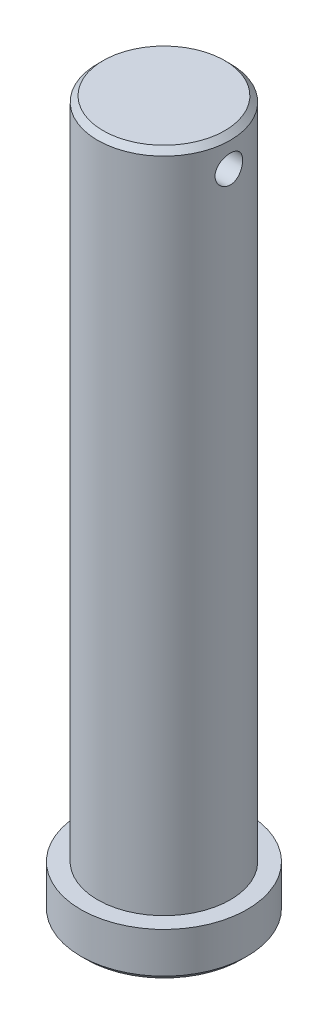
ISO-10303-21;
HEADER;
FILE_DESCRIPTION(('STEP AP214'),'2;1');
FILE_NAME('part.step','',(''),(''),'','','');
FILE_SCHEMA(('AUTOMOTIVE_DESIGN { 1 0 10303 214 1 1 1 1 }'));
ENDSEC;
DATA;
#1=APPLICATION_CONTEXT('core data for automotive mechanical design processes');
#2=APPLICATION_PROTOCOL_DEFINITION('international standard','automotive_design',2000,#1);
#3=PRODUCT_CONTEXT('',#1,'mechanical');
#4=PRODUCT('Part','Part','',(#3));
#5=PRODUCT_RELATED_PRODUCT_CATEGORY('part','',(#4));
#6=PRODUCT_DEFINITION_FORMATION('','',#4);
#7=PRODUCT_DEFINITION_CONTEXT('part definition',#1,'design');
#8=PRODUCT_DEFINITION('design','',#6,#7);
#9=PRODUCT_DEFINITION_SHAPE('','',#8);
#10=(LENGTH_UNIT() NAMED_UNIT(*) SI_UNIT(.MILLI.,.METRE.));
#11=(NAMED_UNIT(*) PLANE_ANGLE_UNIT() SI_UNIT($,.RADIAN.));
#12=(NAMED_UNIT(*) SI_UNIT($,.STERADIAN.) SOLID_ANGLE_UNIT());
#13=UNCERTAINTY_MEASURE_WITH_UNIT(LENGTH_MEASURE(1.E-05),#10,'distance_accuracy_value','');
#14=(GEOMETRIC_REPRESENTATION_CONTEXT(3) GLOBAL_UNCERTAINTY_ASSIGNED_CONTEXT((#13)) GLOBAL_UNIT_ASSIGNED_CONTEXT((#10,
#11,#12)) REPRESENTATION_CONTEXT('',''));
#15=CARTESIAN_POINT('',(0.,0.,0.));
#16=DIRECTION('',(0.,0.,1.));
#17=DIRECTION('',(1.,0.,0.));
#18=AXIS2_PLACEMENT_3D('',#15,#16,#17);
#19=CARTESIAN_POINT('',(0.,0.,0.));
#20=DIRECTION('',(0.,1.,0.));
#21=DIRECTION('',(0.,0.,1.));
#22=AXIS2_PLACEMENT_3D('',#19,#20,#21);
#23=PLANE('',#22);
#24=CARTESIAN_POINT('',(0.,-1.85615411929518E-13,0.));
#25=DIRECTION('',(0.,1.,0.));
#26=DIRECTION('',(0.,0.,1.));
#27=AXIS2_PLACEMENT_3D('',#24,#25,#26);
#28=CIRCLE('',#27,11.1506000000002);
#29=CARTESIAN_POINT('',(0.,-1.85615411929518E-13,11.1506000000002));
#30=VERTEX_POINT('',#29);
#31=EDGE_CURVE('E18',#30,#30,#28,.T.);
#32=ORIENTED_EDGE('',*,*,#31,.F.);
#33=EDGE_LOOP('',(#32));
#34=FACE_BOUND('',#33,.T.);
#35=ADVANCED_FACE('F15',(#34),#23,.F.);
#36=CARTESIAN_POINT('',(0.,0.787399999999931,0.));
#37=DIRECTION('',(0.,1.,0.));
#38=DIRECTION('',(0.,0.,1.));
#39=AXIS2_PLACEMENT_3D('',#36,#37,#38);
#40=CONICAL_SURFACE('',#39,11.9380000000001,0.7853981633973);
#41=CARTESIAN_POINT('',(0.,0.7874,0.));
#42=DIRECTION('',(0.,1.,0.));
#43=DIRECTION('',(0.,0.,1.));
#44=AXIS2_PLACEMENT_3D('',#41,#42,#43);
#45=CIRCLE('',#44,11.938);
#46=CARTESIAN_POINT('',(0.,0.7874,11.938));
#47=VERTEX_POINT('',#46);
#48=EDGE_CURVE('E35',#47,#47,#45,.T.);
#49=ORIENTED_EDGE('',*,*,#48,.F.);
#50=EDGE_LOOP('',(#49));
#51=FACE_BOUND('',#50,.T.);
#52=ORIENTED_EDGE('',*,*,#31,.T.);
#53=EDGE_LOOP('',(#52));
#54=FACE_BOUND('',#53,.T.);
#55=ADVANCED_FACE('F75',(#51,#54),#40,.T.);
#56=CARTESIAN_POINT('',(0.,0.,0.));
#57=DIRECTION('',(0.,1.,0.));
#58=DIRECTION('',(0.,0.,1.));
#59=AXIS2_PLACEMENT_3D('',#56,#57,#58);
#60=CYLINDRICAL_SURFACE('',#59,11.938);
#61=CARTESIAN_POINT('',(0.,6.604,0.));
#62=DIRECTION('',(0.,1.,0.));
#63=DIRECTION('',(0.,0.,1.));
#64=AXIS2_PLACEMENT_3D('',#61,#62,#63);
#65=CIRCLE('',#64,11.938);
#66=CARTESIAN_POINT('',(0.,6.604,11.938));
#67=VERTEX_POINT('',#66);
#68=EDGE_CURVE('E64',#67,#67,#65,.T.);
#69=ORIENTED_EDGE('',*,*,#68,.F.);
#70=EDGE_LOOP('',(#69));
#71=FACE_BOUND('',#70,.T.);
#72=ORIENTED_EDGE('',*,*,#48,.T.);
#73=EDGE_LOOP('',(#72));
#74=FACE_BOUND('',#73,.T.);
#75=ADVANCED_FACE('F81',(#71,#74),#60,.T.);
#76=CARTESIAN_POINT('',(0.,101.854,0.));
#77=DIRECTION('',(0.,1.,0.));
#78=DIRECTION('',(0.,0.,1.));
#79=AXIS2_PLACEMENT_3D('',#76,#77,#78);
#80=PLANE('',#79);
#81=CARTESIAN_POINT('',(0.,101.854000000005,0.));
#82=DIRECTION('',(0.,-1.,0.));
#83=DIRECTION('',(1.,0.,0.));
#84=AXIS2_PLACEMENT_3D('',#81,#82,#83);
#85=CIRCLE('',#84,8.72998000000516);
#86=CARTESIAN_POINT('',(8.72998000000516,101.854000000005,0.));
#87=VERTEX_POINT('',#86);
#88=EDGE_CURVE('E62',#87,#87,#85,.T.);
#89=ORIENTED_EDGE('',*,*,#88,.F.);
#90=EDGE_LOOP('',(#89));
#91=FACE_BOUND('',#90,.T.);
#92=ADVANCED_FACE('F86',(#91),#80,.T.);
#93=CARTESIAN_POINT('',(0.,6.604,0.));
#94=DIRECTION('',(0.,1.,0.));
#95=DIRECTION('',(0.,0.,1.));
#96=AXIS2_PLACEMENT_3D('',#93,#94,#95);
#97=PLANE('',#96);
#98=CARTESIAN_POINT('',(0.,6.604,0.));
#99=DIRECTION('',(0.,1.,0.));
#100=DIRECTION('',(0.,0.,1.));
#101=AXIS2_PLACEMENT_3D('',#98,#99,#100);
#102=CIRCLE('',#101,9.525);
#103=CARTESIAN_POINT('',(0.,6.604,9.525));
#104=VERTEX_POINT('',#103);
#105=EDGE_CURVE('E60',#104,#104,#102,.T.);
#106=ORIENTED_EDGE('',*,*,#105,.F.);
#107=EDGE_LOOP('',(#106));
#108=FACE_BOUND('',#107,.T.);
#109=ORIENTED_EDGE('',*,*,#68,.T.);
#110=EDGE_LOOP('',(#109));
#111=FACE_BOUND('',#110,.T.);
#112=ADVANCED_FACE('F92',(#108,#111),#97,.T.);
#113=CARTESIAN_POINT('',(0.,101.058980000005,0.));
#114=DIRECTION('',(0.,-1.,0.));
#115=DIRECTION('',(1.,0.,0.));
#116=AXIS2_PLACEMENT_3D('',#113,#114,#115);
#117=CONICAL_SURFACE('',#116,9.52500000000503,0.7853981633973);
#118=CARTESIAN_POINT('',(0.,101.05898,0.));
#119=DIRECTION('',(0.,1.,0.));
#120=DIRECTION('',(0.,0.,1.));
#121=AXIS2_PLACEMENT_3D('',#118,#119,#120);
#122=CIRCLE('',#121,9.525);
#123=CARTESIAN_POINT('',(0.,101.05898,9.525));
#124=VERTEX_POINT('',#123);
#125=EDGE_CURVE('E22',#124,#124,#122,.F.);
#126=ORIENTED_EDGE('',*,*,#125,.F.);
#127=EDGE_LOOP('',(#126));
#128=FACE_BOUND('',#127,.T.);
#129=ORIENTED_EDGE('',*,*,#88,.T.);
#130=EDGE_LOOP('',(#129));
#131=FACE_BOUND('',#130,.T.);
#132=ADVANCED_FACE('F51',(#128,#131),#117,.T.);
#133=CARTESIAN_POINT('',(14.3256,97.488375,0.));
#134=DIRECTION('',(-1.,0.,0.));
#135=DIRECTION('',(0.,0.,1.));
#136=AXIS2_PLACEMENT_3D('',#133,#134,#135);
#137=CYLINDRICAL_SURFACE('',#136,1.9812);
#138=CARTESIAN_POINT('',(-9.525,95.507175,0.));
#139=CARTESIAN_POINT('',(-9.52499733400497,95.5071803254945,-0.109898035382377));
#140=CARTESIAN_POINT('',(-9.52307669732504,95.5163586812984,-0.219931440414718));
#141=CARTESIAN_POINT('',(-9.51559391871347,95.5528226969649,-0.436971409090453));
#142=CARTESIAN_POINT('',(-9.51002462045901,95.5801439429235,-0.543971592338459));
#143=CARTESIAN_POINT('',(-9.49586614865825,95.6520102567,-0.751642585302424));
#144=CARTESIAN_POINT('',(-9.48728138552551,95.6965301792042,-0.852322387059948));
#145=CARTESIAN_POINT('',(-9.4680246853225,95.8014640078079,-1.04474686610228));
#146=CARTESIAN_POINT('',(-9.45735341654282,95.8618728269575,-1.13649439026509));
#147=CARTESIAN_POINT('',(-9.43491881389945,95.9978169785548,-1.30983991814781));
#148=CARTESIAN_POINT('',(-9.42314293616179,96.0735412545978,-1.39128814858152));
#149=CARTESIAN_POINT('',(-9.39991595616109,96.2375643933777,-1.54042704035267));
#150=CARTESIAN_POINT('',(-9.38846489828002,96.3258649646552,-1.60811582937659));
#151=CARTESIAN_POINT('',(-9.36706311296609,96.513609837891,-1.72844971662134));
#152=CARTESIAN_POINT('',(-9.3571283295226,96.6131556364854,-1.78093954791731));
#153=CARTESIAN_POINT('',(-9.34006120278303,96.8198942133164,-1.8683896516886));
#154=CARTESIAN_POINT('',(-9.33292853513895,96.9270861048113,-1.90335195312422));
#155=CARTESIAN_POINT('',(-9.32239931167411,97.1444714195906,-1.95426944770922));
#156=CARTESIAN_POINT('',(-9.31895139296922,97.2546010369489,-1.97048620896546));
#157=CARTESIAN_POINT('',(-9.31602760370587,97.4760678387695,-1.98426509053073));
#158=CARTESIAN_POINT('',(-9.31655129894681,97.587404889899,-1.98182925005348));
#159=CARTESIAN_POINT('',(-9.32146495970641,97.8061985198805,-1.95858319077408));
#160=CARTESIAN_POINT('',(-9.32579144726086,97.9136887891243,-1.93807463560147));
#161=CARTESIAN_POINT('',(-9.33772313745262,98.1236697137376,-1.87974193462299));
#162=CARTESIAN_POINT('',(-9.34532853258825,98.2261600751789,-1.8419167721844));
#163=CARTESIAN_POINT('',(-9.36302529491787,98.4240944495021,-1.74973981163127));
#164=CARTESIAN_POINT('',(-9.37313439671364,98.5194815900337,-1.69526943658951));
#165=CARTESIAN_POINT('',(-9.39468741611899,98.6998672031169,-1.57143600057498));
#166=CARTESIAN_POINT('',(-9.40613140224411,98.7848651419635,-1.50207217501313));
#167=CARTESIAN_POINT('',(-9.4293372000749,98.943792187407,-1.34882667414788));
#168=CARTESIAN_POINT('',(-9.44110088057167,99.0174757188536,-1.26469040590461));
#169=CARTESIAN_POINT('',(-9.46342398033929,99.1497560612173,-1.08508400245671));
#170=CARTESIAN_POINT('',(-9.47398287168117,99.2083462723974,-0.989608935793951));
#171=CARTESIAN_POINT('',(-9.49273720855679,99.3088252310339,-0.789725056162616));
#172=CARTESIAN_POINT('',(-9.50092652290055,99.3506707573991,-0.685293958095323));
#173=CARTESIAN_POINT('',(-9.51396049245898,99.4160715756187,-0.470808125859176));
#174=CARTESIAN_POINT('',(-9.51881215860784,99.4396652197374,-0.360765704479302));
#175=CARTESIAN_POINT('',(-9.52281462907828,99.4590455665438,-0.208229520190315));
#176=CARTESIAN_POINT('',(-9.52363228035808,99.4629906549401,-0.166691564302521));
#177=CARTESIAN_POINT('',(-9.52472547240529,99.4682563847887,-0.0834422454389682));
#178=CARTESIAN_POINT('',(-9.52500101234134,99.4695770222162,-0.0417308821973752));
#179=CARTESIAN_POINT('',(-9.52499733400497,99.4695696745054,0.109898035382374));
#180=CARTESIAN_POINT('',(-9.52307669732504,99.4603913187016,0.219931440414715));
#181=CARTESIAN_POINT('',(-9.51559391871347,99.4239273030351,0.436971409090451));
#182=CARTESIAN_POINT('',(-9.51002462045901,99.3966060570764,0.543971592338457));
#183=CARTESIAN_POINT('',(-9.49586614865825,99.3247397433,0.751642585302427));
#184=CARTESIAN_POINT('',(-9.48728138552551,99.2802198207958,0.852322387059954));
#185=CARTESIAN_POINT('',(-9.4680246853225,99.175285992192,1.04474686610229));
#186=CARTESIAN_POINT('',(-9.45735341654283,99.1148771730425,1.13649439026509));
#187=CARTESIAN_POINT('',(-9.43491881389945,98.9789330214452,1.30983991814781));
#188=CARTESIAN_POINT('',(-9.42314293616179,98.9032087454022,1.39128814858152));
#189=CARTESIAN_POINT('',(-9.39991595616108,98.7391856066223,1.54042704035267));
#190=CARTESIAN_POINT('',(-9.38846489828002,98.6508850353448,1.60811582937659));
#191=CARTESIAN_POINT('',(-9.36706311296609,98.4631401621089,1.72844971662134));
#192=CARTESIAN_POINT('',(-9.3571283295226,98.3635943635146,1.78093954791731));
#193=CARTESIAN_POINT('',(-9.34006120278303,98.1568557866836,1.8683896516886));
#194=CARTESIAN_POINT('',(-9.33292853513895,98.0496638951887,1.90335195312422));
#195=CARTESIAN_POINT('',(-9.32239931167411,97.8322785804094,1.95426944770922));
#196=CARTESIAN_POINT('',(-9.31895139296922,97.7221489630511,1.97048620896546));
#197=CARTESIAN_POINT('',(-9.31602760370587,97.5006821612304,1.98426509053073));
#198=CARTESIAN_POINT('',(-9.31655129894681,97.389345110101,1.98182925005348));
#199=CARTESIAN_POINT('',(-9.32146495970641,97.1705514801195,1.95858319077408));
#200=CARTESIAN_POINT('',(-9.32579144726086,97.0630612108757,1.93807463560147));
#201=CARTESIAN_POINT('',(-9.33772313745261,96.8530802862624,1.87974193462299));
#202=CARTESIAN_POINT('',(-9.34532853258825,96.7505899248211,1.8419167721844));
#203=CARTESIAN_POINT('',(-9.36302529491787,96.5526555504979,1.74973981163128));
#204=CARTESIAN_POINT('',(-9.37313439671363,96.4572684099663,1.69526943658953));
#205=CARTESIAN_POINT('',(-9.39468741611899,96.2768827968831,1.57143600057499));
#206=CARTESIAN_POINT('',(-9.40613140224411,96.1918848580364,1.50207217501313));
#207=CARTESIAN_POINT('',(-9.4293372000749,96.032957812593,1.34882667414788));
#208=CARTESIAN_POINT('',(-9.44110088057167,95.9592742811463,1.26469040590461));
#209=CARTESIAN_POINT('',(-9.46342398033929,95.8269939387827,1.08508400245671));
#210=CARTESIAN_POINT('',(-9.47398287168117,95.7684037276025,0.989608935793951));
#211=CARTESIAN_POINT('',(-9.49273720855679,95.6679247689661,0.789725056162617));
#212=CARTESIAN_POINT('',(-9.50092652290055,95.6260792426008,0.685293958095324));
#213=CARTESIAN_POINT('',(-9.51396049245898,95.5606784243813,0.470808125859179));
#214=CARTESIAN_POINT('',(-9.51881215860784,95.5370847802625,0.360765704479305));
#215=CARTESIAN_POINT('',(-9.52281462907828,95.5177044334562,0.208229520190316));
#216=CARTESIAN_POINT('',(-9.52363228035808,95.5137593450598,0.166691564302522));
#217=CARTESIAN_POINT('',(-9.52472547240529,95.5084936152113,0.0834422454389671));
#218=CARTESIAN_POINT('',(-9.52500101234134,95.5071729777838,0.0417308821973735));
#219=CARTESIAN_POINT('',(-9.525,95.507175,0.));
#220=B_SPLINE_CURVE_WITH_KNOTS('',3,(#138,#139,#140,#141,#142,#143,#144,#145,#146,#147,#148,
#149,#150,#151,#152,#153,#154,#155,#156,#157,#158,#159,#160,#161,#162,#163,#164,#165,#166,#167,
#168,#169,#170,#171,#172,#173,#174,#175,#176,#177,#178,#179,#180,#181,#182,#183,#184,#185,#186,
#187,#188,#189,#190,#191,#192,#193,#194,#195,#196,#197,#198,#199,#200,#201,#202,#203,#204,#205,
#206,#207,#208,#209,#210,#211,#212,#213,#214,#215,#216,#217,#218,#219),.UNSPECIFIED.,.T.,.F.,(4,
2,2,2,2,2,2,2,2,2,2,2,2,2,2,2,2,2,2,2,2,2,2,2,2,2,2,2,2,2,2,2,2,2,2,2,2,2,2,2,4),(0.,
0.329534495870123,0.659717268896652,0.989419114342882,1.31901553147453,1.65295773196094,
1.98694534319835,2.32423332003639,2.66148224390856,2.99396624978096,3.32641390703669,
3.65341539132337,3.98043607585186,4.30984295074753,4.63926674053772,4.97505496986407,
5.31098977838236,5.64778618773076,5.98387295753687,6.10900480443579,6.23413684323229,
6.56367133910241,6.89385411212894,7.22355595757519,7.55315237470682,7.88709457519322,
8.22108218643064,8.55837016326868,8.89561908714086,9.22810309301325,9.56055075026898,
9.88755223455565,10.2145729190841,10.5439797939798,10.87340358377,11.2091918130964,
11.5451266216146,11.881923030963,12.2180098007692,12.3431416476681,12.4682736864646),.UNSPECIFIED.);
#221=CARTESIAN_POINT('',(-9.525,95.507175,0.));
#222=VERTEX_POINT('',#221);
#223=EDGE_CURVE('E27',#222,#222,#220,.T.);
#224=ORIENTED_EDGE('',*,*,#223,.F.);
#225=EDGE_LOOP('',(#224));
#226=FACE_BOUND('',#225,.T.);
#227=CARTESIAN_POINT('',(9.525,99.469575,0.));
#228=CARTESIAN_POINT('',(9.52499733400497,99.4695696745054,-0.109898035382375));
#229=CARTESIAN_POINT('',(9.52307669732504,99.4603913187016,-0.219931440414716));
#230=CARTESIAN_POINT('',(9.51559391871347,99.4239273030351,-0.436971409090452));
#231=CARTESIAN_POINT('',(9.51002462045901,99.3966060570764,-0.543971592338458));
#232=CARTESIAN_POINT('',(9.49586614865825,99.3247397433,-0.751642585302427));
#233=CARTESIAN_POINT('',(9.48728138552551,99.2802198207958,-0.852322387059954));
#234=CARTESIAN_POINT('',(9.4680246853225,99.175285992192,-1.04474686610229));
#235=CARTESIAN_POINT('',(9.45735341654282,99.1148771730425,-1.13649439026509));
#236=CARTESIAN_POINT('',(9.43491881389945,98.9789330214452,-1.30983991814781));
#237=CARTESIAN_POINT('',(9.42314293616179,98.9032087454022,-1.39128814858152));
#238=CARTESIAN_POINT('',(9.39991595616109,98.7391856066223,-1.54042704035267));
#239=CARTESIAN_POINT('',(9.38846489828002,98.6508850353448,-1.60811582937659));
#240=CARTESIAN_POINT('',(9.36706311296609,98.4631401621089,-1.72844971662134));
#241=CARTESIAN_POINT('',(9.3571283295226,98.3635943635146,-1.78093954791731));
#242=CARTESIAN_POINT('',(9.34006120278303,98.1568557866836,-1.8683896516886));
#243=CARTESIAN_POINT('',(9.33292853513895,98.0496638951887,-1.90335195312422));
#244=CARTESIAN_POINT('',(9.32239931167411,97.8322785804094,-1.95426944770922));
#245=CARTESIAN_POINT('',(9.31895139296922,97.7221489630511,-1.97048620896546));
#246=CARTESIAN_POINT('',(9.31602760370587,97.5006821612304,-1.98426509053073));
#247=CARTESIAN_POINT('',(9.31655129894681,97.389345110101,-1.98182925005348));
#248=CARTESIAN_POINT('',(9.32146495970641,97.1705514801195,-1.95858319077408));
#249=CARTESIAN_POINT('',(9.32579144726086,97.0630612108757,-1.93807463560147));
#250=CARTESIAN_POINT('',(9.33772313745261,96.8530802862624,-1.87974193462299));
#251=CARTESIAN_POINT('',(9.34532853258825,96.7505899248211,-1.8419167721844));
#252=CARTESIAN_POINT('',(9.36302529491787,96.5526555504979,-1.74973981163127));
#253=CARTESIAN_POINT('',(9.37313439671364,96.4572684099663,-1.69526943658952));
#254=CARTESIAN_POINT('',(9.39468741611899,96.2768827968831,-1.57143600057498));
#255=CARTESIAN_POINT('',(9.40613140224411,96.1918848580364,-1.50207217501313));
#256=CARTESIAN_POINT('',(9.42933720007491,96.032957812593,-1.34882667414788));
#257=CARTESIAN_POINT('',(9.44110088057167,95.9592742811463,-1.26469040590461));
#258=CARTESIAN_POINT('',(9.46342398033929,95.8269939387827,-1.08508400245671));
#259=CARTESIAN_POINT('',(9.47398287168117,95.7684037276025,-0.989608935793951));
#260=CARTESIAN_POINT('',(9.49273720855679,95.6679247689661,-0.789725056162617));
#261=CARTESIAN_POINT('',(9.50092652290055,95.6260792426008,-0.685293958095323));
#262=CARTESIAN_POINT('',(9.51396049245898,95.5606784243813,-0.470808125859177));
#263=CARTESIAN_POINT('',(9.51881215860784,95.5370847802625,-0.360765704479304));
#264=CARTESIAN_POINT('',(9.52281462907828,95.5177044334562,-0.208229520190316));
#265=CARTESIAN_POINT('',(9.52363228035808,95.5137593450598,-0.166691564302522));
#266=CARTESIAN_POINT('',(9.52472547240529,95.5084936152113,-0.0834422454389673));
#267=CARTESIAN_POINT('',(9.52500101234134,95.5071729777838,-0.0417308821973735));
#268=CARTESIAN_POINT('',(9.52499733400497,95.5071803254945,0.109898035382377));
#269=CARTESIAN_POINT('',(9.52307669732504,95.5163586812984,0.219931440414718));
#270=CARTESIAN_POINT('',(9.51559391871347,95.5528226969649,0.436971409090452));
#271=CARTESIAN_POINT('',(9.51002462045901,95.5801439429235,0.543971592338458));
#272=CARTESIAN_POINT('',(9.49586614865825,95.6520102567,0.751642585302428));
#273=CARTESIAN_POINT('',(9.48728138552551,95.6965301792042,0.852322387059954));
#274=CARTESIAN_POINT('',(9.4680246853225,95.8014640078079,1.04474686610229));
#275=CARTESIAN_POINT('',(9.45735341654282,95.8618728269575,1.13649439026509));
#276=CARTESIAN_POINT('',(9.43491881389945,95.9978169785548,1.30983991814781));
#277=CARTESIAN_POINT('',(9.42314293616179,96.0735412545977,1.39128814858152));
#278=CARTESIAN_POINT('',(9.39991595616109,96.2375643933776,1.54042704035267));
#279=CARTESIAN_POINT('',(9.38846489828002,96.3258649646552,1.60811582937659));
#280=CARTESIAN_POINT('',(9.36706311296609,96.513609837891,1.72844971662134));
#281=CARTESIAN_POINT('',(9.3571283295226,96.6131556364854,1.78093954791731));
#282=CARTESIAN_POINT('',(9.34006120278303,96.8198942133164,1.8683896516886));
#283=CARTESIAN_POINT('',(9.33292853513895,96.9270861048113,1.90335195312422));
#284=CARTESIAN_POINT('',(9.32239931167411,97.1444714195906,1.95426944770922));
#285=CARTESIAN_POINT('',(9.31895139296922,97.2546010369489,1.97048620896546));
#286=CARTESIAN_POINT('',(9.31602760370587,97.4760678387695,1.98426509053073));
#287=CARTESIAN_POINT('',(9.31655129894681,97.587404889899,1.98182925005348));
#288=CARTESIAN_POINT('',(9.32146495970641,97.8061985198805,1.95858319077408));
#289=CARTESIAN_POINT('',(9.32579144726086,97.9136887891243,1.93807463560147));
#290=CARTESIAN_POINT('',(9.33772313745261,98.1236697137376,1.87974193462299));
#291=CARTESIAN_POINT('',(9.34532853258825,98.2261600751789,1.8419167721844));
#292=CARTESIAN_POINT('',(9.36302529491787,98.4240944495021,1.74973981163127));
#293=CARTESIAN_POINT('',(9.37313439671364,98.5194815900337,1.69526943658952));
#294=CARTESIAN_POINT('',(9.39468741611899,98.6998672031169,1.57143600057498));
#295=CARTESIAN_POINT('',(9.40613140224411,98.7848651419635,1.50207217501313));
#296=CARTESIAN_POINT('',(9.42933720007491,98.943792187407,1.34882667414788));
#297=CARTESIAN_POINT('',(9.44110088057167,99.0174757188537,1.26469040590461));
#298=CARTESIAN_POINT('',(9.46342398033929,99.1497560612173,1.08508400245671));
#299=CARTESIAN_POINT('',(9.47398287168117,99.2083462723974,0.989608935793948));
#300=CARTESIAN_POINT('',(9.49273720855679,99.3088252310339,0.789725056162616));
#301=CARTESIAN_POINT('',(9.50092652290055,99.3506707573991,0.685293958095323));
#302=CARTESIAN_POINT('',(9.51396049245898,99.4160715756187,0.470808125859177));
#303=CARTESIAN_POINT('',(9.51881215860784,99.4396652197374,0.360765704479303));
#304=CARTESIAN_POINT('',(9.52281462907828,99.4590455665438,0.208229520190315));
#305=CARTESIAN_POINT('',(9.52363228035808,99.4629906549401,0.166691564302522));
#306=CARTESIAN_POINT('',(9.52472547240529,99.4682563847887,0.0834422454389677));
#307=CARTESIAN_POINT('',(9.52500101234134,99.4695770222162,0.0417308821973745));
#308=CARTESIAN_POINT('',(9.525,99.469575,0.));
#309=B_SPLINE_CURVE_WITH_KNOTS('',3,(#227,#228,#229,#230,#231,#232,#233,#234,#235,#236,#237,
#238,#239,#240,#241,#242,#243,#244,#245,#246,#247,#248,#249,#250,#251,#252,#253,#254,#255,#256,
#257,#258,#259,#260,#261,#262,#263,#264,#265,#266,#267,#268,#269,#270,#271,#272,#273,#274,#275,
#276,#277,#278,#279,#280,#281,#282,#283,#284,#285,#286,#287,#288,#289,#290,#291,#292,#293,#294,
#295,#296,#297,#298,#299,#300,#301,#302,#303,#304,#305,#306,#307,#308),.UNSPECIFIED.,.T.,.F.,(4,
2,2,2,2,2,2,2,2,2,2,2,2,2,2,2,2,2,2,2,2,2,2,2,2,2,2,2,2,2,2,2,2,2,2,2,2,2,2,2,4),(0.,
0.329534495870123,0.659717268896652,0.989419114342899,1.31901553147453,1.65295773196094,
1.98694534319835,2.32423332003639,2.66148224390856,2.99396624978096,3.32641390703669,
3.65341539132336,3.98043607585184,4.30984295074753,4.63926674053772,4.97505496986407,
5.31098977838236,5.64778618773076,5.98387295753686,6.10900480443579,6.23413684323229,
6.56367133910241,6.89385411212894,7.22355595757519,7.55315237470682,7.88709457519322,
8.22108218643064,8.55837016326868,8.89561908714086,9.22810309301325,9.56055075026898,
9.88755223455565,10.2145729190841,10.5439797939798,10.87340358377,11.2091918130964,
11.5451266216146,11.8819230309631,12.2180098007692,12.3431416476681,12.4682736864646),.UNSPECIFIED.);
#310=CARTESIAN_POINT('',(9.525,99.469575,0.));
#311=VERTEX_POINT('',#310);
#312=EDGE_CURVE('E10',#311,#311,#309,.T.);
#313=ORIENTED_EDGE('',*,*,#312,.F.);
#314=EDGE_LOOP('',(#313));
#315=FACE_BOUND('',#314,.T.);
#316=ADVANCED_FACE('F39',(#226,#315),#137,.F.);
#317=CARTESIAN_POINT('',(0.,6.604,0.));
#318=DIRECTION('',(0.,1.,0.));
#319=DIRECTION('',(0.,0.,1.));
#320=AXIS2_PLACEMENT_3D('',#317,#318,#319);
#321=CYLINDRICAL_SURFACE('',#320,9.525);
#322=ORIENTED_EDGE('',*,*,#125,.T.);
#323=EDGE_LOOP('',(#322));
#324=FACE_BOUND('',#323,.T.);
#325=ORIENTED_EDGE('',*,*,#223,.T.);
#326=EDGE_LOOP('',(#325));
#327=FACE_BOUND('',#326,.T.);
#328=ORIENTED_EDGE('',*,*,#105,.T.);
#329=EDGE_LOOP('',(#328));
#330=FACE_BOUND('',#329,.T.);
#331=ORIENTED_EDGE('',*,*,#312,.T.);
#332=EDGE_LOOP('',(#331));
#333=FACE_BOUND('',#332,.T.);
#334=ADVANCED_FACE('F42',(#324,#327,#330,#333),#321,.T.);
#335=CLOSED_SHELL('',(#35,#55,#75,#92,#112,#132,#316,#334));
#336=MANIFOLD_SOLID_BREP('B1',#335);
#337=ADVANCED_BREP_SHAPE_REPRESENTATION('',(#18,#336),#14);
#338=SHAPE_DEFINITION_REPRESENTATION(#9,#337);
ENDSEC;
END-ISO-10303-21;
